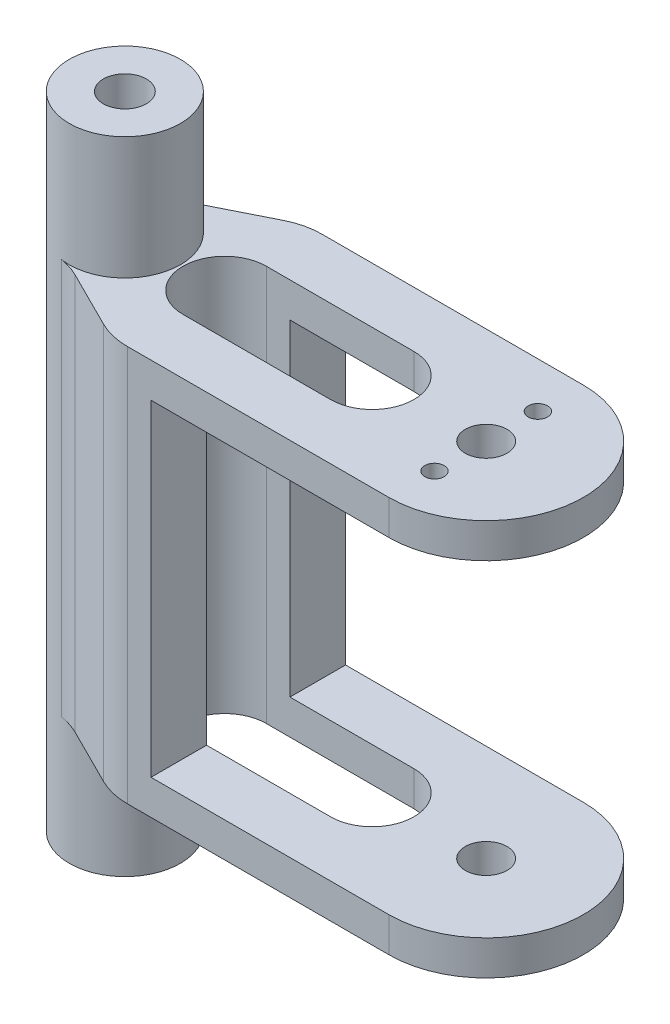
ISO-10303-21;
HEADER;
FILE_DESCRIPTION(('STEP AP214'),'2;1');
FILE_NAME('part.step','',(''),(''),'','','');
FILE_SCHEMA(('AUTOMOTIVE_DESIGN { 1 0 10303 214 1 1 1 1 }'));
ENDSEC;
DATA;
#1=APPLICATION_CONTEXT('core data for automotive mechanical design processes');
#2=APPLICATION_PROTOCOL_DEFINITION('international standard','automotive_design',2000,#1);
#3=PRODUCT_CONTEXT('',#1,'mechanical');
#4=PRODUCT('Part','Part','',(#3));
#5=PRODUCT_RELATED_PRODUCT_CATEGORY('part','',(#4));
#6=PRODUCT_DEFINITION_FORMATION('','',#4);
#7=PRODUCT_DEFINITION_CONTEXT('part definition',#1,'design');
#8=PRODUCT_DEFINITION('design','',#6,#7);
#9=PRODUCT_DEFINITION_SHAPE('','',#8);
#10=(LENGTH_UNIT() NAMED_UNIT(*) SI_UNIT(.MILLI.,.METRE.));
#11=(NAMED_UNIT(*) PLANE_ANGLE_UNIT() SI_UNIT($,.RADIAN.));
#12=(NAMED_UNIT(*) SI_UNIT($,.STERADIAN.) SOLID_ANGLE_UNIT());
#13=UNCERTAINTY_MEASURE_WITH_UNIT(LENGTH_MEASURE(1.E-05),#10,'distance_accuracy_value','');
#14=(GEOMETRIC_REPRESENTATION_CONTEXT(3) GLOBAL_UNCERTAINTY_ASSIGNED_CONTEXT((#13)) GLOBAL_UNIT_ASSIGNED_CONTEXT((#10,
#11,#12)) REPRESENTATION_CONTEXT('',''));
#15=CARTESIAN_POINT('',(0.,0.,0.));
#16=DIRECTION('',(0.,0.,1.));
#17=DIRECTION('',(1.,0.,0.));
#18=AXIS2_PLACEMENT_3D('',#15,#16,#17);
#19=CARTESIAN_POINT('',(-57.1806055924693,52.,14.));
#20=DIRECTION('',(-1.,0.,0.));
#21=DIRECTION('',(0.,0.,1.));
#22=AXIS2_PLACEMENT_3D('',#19,#20,#21);
#23=PLANE('',#22);
#24=DIRECTION('',(0.,-1.,0.));
#25=VECTOR('',#24,1.);
#26=CARTESIAN_POINT('',(-57.1806055924693,52.,6.));
#27=LINE('',#26,#25);
#28=CARTESIAN_POINT('',(-57.1806055924693,52.,6.));
#29=VERTEX_POINT('',#28);
#30=CARTESIAN_POINT('',(-57.1806055924693,5.,6.));
#31=VERTEX_POINT('',#30);
#32=EDGE_CURVE('E258',#29,#31,#27,.T.);
#33=ORIENTED_EDGE('',*,*,#32,.F.);
#34=DIRECTION('',(0.,0.,-1.));
#35=VECTOR('',#34,1.);
#36=CARTESIAN_POINT('',(-57.1806055924693,52.,14.));
#37=LINE('',#36,#35);
#38=CARTESIAN_POINT('',(-57.1806055924693,52.,14.));
#39=VERTEX_POINT('',#38);
#40=EDGE_CURVE('E345',#39,#29,#37,.T.);
#41=ORIENTED_EDGE('',*,*,#40,.F.);
#42=DIRECTION('',(0.,-1.,0.));
#43=VECTOR('',#42,1.);
#44=CARTESIAN_POINT('',(-57.1806055924693,52.,14.));
#45=LINE('',#44,#43);
#46=CARTESIAN_POINT('',(-57.1806055924693,5.,14.));
#47=VERTEX_POINT('',#46);
#48=EDGE_CURVE('E358',#39,#47,#45,.T.);
#49=ORIENTED_EDGE('',*,*,#48,.T.);
#50=DIRECTION('',(0.,0.,-1.));
#51=VECTOR('',#50,1.);
#52=CARTESIAN_POINT('',(-57.1806055924693,5.,14.));
#53=LINE('',#52,#51);
#54=EDGE_CURVE('E351',#47,#31,#53,.T.);
#55=ORIENTED_EDGE('',*,*,#54,.T.);
#56=EDGE_LOOP('',(#33,#41,#49,#55));
#57=FACE_BOUND('',#56,.T.);
#58=ADVANCED_FACE('F41',(#57),#23,.F.);
#59=CARTESIAN_POINT('',(0.,5.,14.));
#60=DIRECTION('',(0.,0.,-1.));
#61=DIRECTION('',(-1.,0.,0.));
#62=AXIS2_PLACEMENT_3D('',#59,#60,#61);
#63=PLANE('',#62);
#64=DIRECTION('',(1.,0.,0.));
#65=VECTOR('',#64,1.);
#66=CARTESIAN_POINT('',(0.,57.,14.));
#67=LINE('',#66,#65);
#68=CARTESIAN_POINT('',(-60.5813685126219,57.,14.));
#69=VERTEX_POINT('',#68);
#70=CARTESIAN_POINT('',(-22.9420482876198,57.,14.));
#71=VERTEX_POINT('',#70);
#72=EDGE_CURVE('E309',#69,#71,#67,.T.);
#73=ORIENTED_EDGE('',*,*,#72,.F.);
#74=DIRECTION('',(0.,-1.,0.));
#75=VECTOR('',#74,1.);
#76=CARTESIAN_POINT('',(-60.5813685126219,5.,14.));
#77=LINE('',#76,#75);
#78=CARTESIAN_POINT('',(-60.5813685126219,0.,14.));
#79=VERTEX_POINT('',#78);
#80=EDGE_CURVE('E419',#69,#79,#77,.T.);
#81=ORIENTED_EDGE('',*,*,#80,.T.);
#82=DIRECTION('',(1.,0.,0.));
#83=VECTOR('',#82,1.);
#84=CARTESIAN_POINT('',(0.,0.,14.));
#85=LINE('',#84,#83);
#86=CARTESIAN_POINT('',(-22.9420482876198,0.,14.));
#87=VERTEX_POINT('',#86);
#88=EDGE_CURVE('E362',#79,#87,#85,.T.);
#89=ORIENTED_EDGE('',*,*,#88,.T.);
#90=DIRECTION('',(0.,-1.,0.));
#91=VECTOR('',#90,1.);
#92=CARTESIAN_POINT('',(-22.9420482876198,5.,14.));
#93=LINE('',#92,#91);
#94=CARTESIAN_POINT('',(-22.9420482876198,5.,14.));
#95=VERTEX_POINT('',#94);
#96=EDGE_CURVE('E394',#95,#87,#93,.T.);
#97=ORIENTED_EDGE('',*,*,#96,.F.);
#98=DIRECTION('',(1.,0.,0.));
#99=VECTOR('',#98,1.);
#100=CARTESIAN_POINT('',(0.,5.,14.));
#101=LINE('',#100,#99);
#102=EDGE_CURVE('E363',#47,#95,#101,.T.);
#103=ORIENTED_EDGE('',*,*,#102,.F.);
#104=ORIENTED_EDGE('',*,*,#48,.F.);
#105=DIRECTION('',(1.,0.,0.));
#106=VECTOR('',#105,1.);
#107=CARTESIAN_POINT('',(0.,52.,14.));
#108=LINE('',#107,#106);
#109=CARTESIAN_POINT('',(-22.9420482876198,52.,14.));
#110=VERTEX_POINT('',#109);
#111=EDGE_CURVE('E301',#39,#110,#108,.T.);
#112=ORIENTED_EDGE('',*,*,#111,.T.);
#113=DIRECTION('',(0.,-1.,0.));
#114=VECTOR('',#113,1.);
#115=CARTESIAN_POINT('',(-22.9420482876198,57.,14.));
#116=LINE('',#115,#114);
#117=EDGE_CURVE('E340',#71,#110,#116,.T.);
#118=ORIENTED_EDGE('',*,*,#117,.F.);
#119=EDGE_LOOP('',(#73,#81,#89,#97,#103,#104,#112,#118));
#120=FACE_BOUND('',#119,.T.);
#121=ADVANCED_FACE('F484',(#120),#63,.F.);
#122=CARTESIAN_POINT('',(-22.9420482876198,5.,0.));
#123=DIRECTION('',(0.,-1.,0.));
#124=DIRECTION('',(0.,0.,-1.));
#125=AXIS2_PLACEMENT_3D('',#122,#123,#124);
#126=CYLINDRICAL_SURFACE('',#125,14.);
#127=CARTESIAN_POINT('',(-22.9420482876198,0.,0.));
#128=DIRECTION('',(0.,1.,0.));
#129=DIRECTION('',(0.,0.,1.));
#130=AXIS2_PLACEMENT_3D('',#127,#128,#129);
#131=CIRCLE('',#130,14.);
#132=CARTESIAN_POINT('',(-22.9420482876198,0.,-14.));
#133=VERTEX_POINT('',#132);
#134=EDGE_CURVE('E381',#87,#133,#131,.T.);
#135=ORIENTED_EDGE('',*,*,#134,.T.);
#136=DIRECTION('',(0.,-1.,0.));
#137=VECTOR('',#136,1.);
#138=CARTESIAN_POINT('',(-22.9420482876198,5.,-14.));
#139=LINE('',#138,#137);
#140=CARTESIAN_POINT('',(-22.9420482876198,5.,-14.));
#141=VERTEX_POINT('',#140);
#142=EDGE_CURVE('E378',#141,#133,#139,.T.);
#143=ORIENTED_EDGE('',*,*,#142,.F.);
#144=CARTESIAN_POINT('',(-22.9420482876198,5.,0.));
#145=DIRECTION('',(0.,1.,0.));
#146=DIRECTION('',(0.,0.,1.));
#147=AXIS2_PLACEMENT_3D('',#144,#145,#146);
#148=CIRCLE('',#147,14.);
#149=EDGE_CURVE('E366',#95,#141,#148,.T.);
#150=ORIENTED_EDGE('',*,*,#149,.F.);
#151=ORIENTED_EDGE('',*,*,#96,.T.);
#152=EDGE_LOOP('',(#135,#143,#150,#151));
#153=FACE_BOUND('',#152,.T.);
#154=ADVANCED_FACE('F477',(#153),#126,.T.);
#155=CARTESIAN_POINT('',(0.,5.,-14.));
#156=DIRECTION('',(0.,0.,1.));
#157=DIRECTION('',(1.,0.,0.));
#158=AXIS2_PLACEMENT_3D('',#155,#156,#157);
#159=PLANE('',#158);
#160=DIRECTION('',(-1.,0.,0.));
#161=VECTOR('',#160,1.);
#162=CARTESIAN_POINT('',(0.,0.,-14.));
#163=LINE('',#162,#161);
#164=CARTESIAN_POINT('',(-60.5813685126219,0.,-14.));
#165=VERTEX_POINT('',#164);
#166=EDGE_CURVE('E384',#133,#165,#163,.T.);
#167=ORIENTED_EDGE('',*,*,#166,.T.);
#168=DIRECTION('',(0.,-1.,0.));
#169=VECTOR('',#168,1.);
#170=CARTESIAN_POINT('',(-60.5813685126219,57.,-14.));
#171=LINE('',#170,#169);
#172=CARTESIAN_POINT('',(-60.5813685126219,57.,-14.));
#173=VERTEX_POINT('',#172);
#174=EDGE_CURVE('E409',#165,#173,#171,.F.);
#175=ORIENTED_EDGE('',*,*,#174,.T.);
#176=DIRECTION('',(-1.,0.,0.));
#177=VECTOR('',#176,1.);
#178=CARTESIAN_POINT('',(0.,57.,-14.));
#179=LINE('',#178,#177);
#180=CARTESIAN_POINT('',(-22.9420482876198,57.,-14.));
#181=VERTEX_POINT('',#180);
#182=EDGE_CURVE('E316',#181,#173,#179,.T.);
#183=ORIENTED_EDGE('',*,*,#182,.F.);
#184=DIRECTION('',(0.,-1.,0.));
#185=VECTOR('',#184,1.);
#186=CARTESIAN_POINT('',(-22.9420482876198,57.,-14.));
#187=LINE('',#186,#185);
#188=CARTESIAN_POINT('',(-22.9420482876198,52.,-14.));
#189=VERTEX_POINT('',#188);
#190=EDGE_CURVE('E324',#181,#189,#187,.T.);
#191=ORIENTED_EDGE('',*,*,#190,.T.);
#192=DIRECTION('',(-1.,0.,0.));
#193=VECTOR('',#192,1.);
#194=CARTESIAN_POINT('',(0.,52.,-14.));
#195=LINE('',#194,#193);
#196=CARTESIAN_POINT('',(-57.1806055924693,52.,-14.));
#197=VERTEX_POINT('',#196);
#198=EDGE_CURVE('E330',#189,#197,#195,.T.);
#199=ORIENTED_EDGE('',*,*,#198,.T.);
#200=DIRECTION('',(0.,-1.,0.));
#201=VECTOR('',#200,1.);
#202=CARTESIAN_POINT('',(-57.1806055924693,52.,-14.));
#203=LINE('',#202,#201);
#204=CARTESIAN_POINT('',(-57.1806055924693,5.,-14.));
#205=VERTEX_POINT('',#204);
#206=EDGE_CURVE('E349',#197,#205,#203,.T.);
#207=ORIENTED_EDGE('',*,*,#206,.T.);
#208=DIRECTION('',(-1.,0.,0.));
#209=VECTOR('',#208,1.);
#210=CARTESIAN_POINT('',(0.,5.,-14.));
#211=LINE('',#210,#209);
#212=EDGE_CURVE('E370',#141,#205,#211,.T.);
#213=ORIENTED_EDGE('',*,*,#212,.F.);
#214=ORIENTED_EDGE('',*,*,#142,.T.);
#215=EDGE_LOOP('',(#167,#175,#183,#191,#199,#207,#213,#214));
#216=FACE_BOUND('',#215,.T.);
#217=ADVANCED_FACE('F472',(#216),#159,.F.);
#218=CARTESIAN_POINT('',(-22.9420482876198,5.,0.));
#219=DIRECTION('',(0.,-1.,0.));
#220=DIRECTION('',(0.,0.,-1.));
#221=AXIS2_PLACEMENT_3D('',#218,#219,#220);
#222=CYLINDRICAL_SURFACE('',#221,3.);
#223=CARTESIAN_POINT('',(-22.9420482876198,5.,0.));
#224=DIRECTION('',(0.,1.,0.));
#225=DIRECTION('',(0.,0.,1.));
#226=AXIS2_PLACEMENT_3D('',#223,#224,#225);
#227=CIRCLE('',#226,3.);
#228=CARTESIAN_POINT('',(-22.9420482876198,5.,3.));
#229=VERTEX_POINT('',#228);
#230=EDGE_CURVE('E374',#229,#229,#227,.T.);
#231=ORIENTED_EDGE('',*,*,#230,.T.);
#232=EDGE_LOOP('',(#231));
#233=FACE_BOUND('',#232,.T.);
#234=CARTESIAN_POINT('',(-22.9420482876198,0.,0.));
#235=DIRECTION('',(0.,1.,0.));
#236=DIRECTION('',(0.,0.,1.));
#237=AXIS2_PLACEMENT_3D('',#234,#235,#236);
#238=CIRCLE('',#237,3.);
#239=CARTESIAN_POINT('',(-22.9420482876198,0.,3.));
#240=VERTEX_POINT('',#239);
#241=EDGE_CURVE('E367',#240,#240,#238,.T.);
#242=ORIENTED_EDGE('',*,*,#241,.F.);
#243=EDGE_LOOP('',(#242));
#244=FACE_BOUND('',#243,.T.);
#245=ADVANCED_FACE('F627',(#233,#244),#222,.F.);
#246=CARTESIAN_POINT('',(0.,5.,0.));
#247=DIRECTION('',(0.,1.,0.));
#248=DIRECTION('',(0.,0.,1.));
#249=AXIS2_PLACEMENT_3D('',#246,#247,#248);
#250=PLANE('',#249);
#251=DIRECTION('',(-1.,0.,0.));
#252=VECTOR('',#251,1.);
#253=CARTESIAN_POINT('',(0.,5.,-5.99999999999999));
#254=LINE('',#253,#252);
#255=CARTESIAN_POINT('',(-39.3384096662004,5.00000000000001,-6.));
#256=VERTEX_POINT('',#255);
#257=CARTESIAN_POINT('',(-57.1806055924693,5.,-6.));
#258=VERTEX_POINT('',#257);
#259=EDGE_CURVE('E271',#256,#258,#254,.T.);
#260=ORIENTED_EDGE('',*,*,#259,.F.);
#261=CARTESIAN_POINT('',(-39.3384096662004,5.,0.));
#262=DIRECTION('',(0.,1.,0.));
#263=DIRECTION('',(0.,0.,1.));
#264=AXIS2_PLACEMENT_3D('',#261,#262,#263);
#265=CIRCLE('',#264,6.);
#266=CARTESIAN_POINT('',(-39.3384096662004,5.00000000000001,6.));
#267=VERTEX_POINT('',#266);
#268=EDGE_CURVE('E252',#267,#256,#265,.T.);
#269=ORIENTED_EDGE('',*,*,#268,.F.);
#270=DIRECTION('',(-1.,0.,0.));
#271=VECTOR('',#270,1.);
#272=CARTESIAN_POINT('',(0.,5.,6.00000000000001));
#273=LINE('',#272,#271);
#274=EDGE_CURVE('E261',#267,#31,#273,.T.);
#275=ORIENTED_EDGE('',*,*,#274,.T.);
#276=ORIENTED_EDGE('',*,*,#54,.F.);
#277=ORIENTED_EDGE('',*,*,#102,.T.);
#278=ORIENTED_EDGE('',*,*,#149,.T.);
#279=ORIENTED_EDGE('',*,*,#212,.T.);
#280=EDGE_CURVE('E344',#258,#205,#53,.T.);
#281=ORIENTED_EDGE('',*,*,#280,.F.);
#282=EDGE_LOOP('',(#260,#269,#275,#276,#277,#278,#279,#281));
#283=FACE_BOUND('',#282,.T.);
#284=ORIENTED_EDGE('',*,*,#230,.F.);
#285=EDGE_LOOP('',(#284));
#286=FACE_BOUND('',#285,.T.);
#287=ADVANCED_FACE('F537',(#283,#286),#250,.T.);
#288=CARTESIAN_POINT('',(0.,0.,0.));
#289=DIRECTION('',(0.,1.,0.));
#290=DIRECTION('',(0.,0.,1.));
#291=AXIS2_PLACEMENT_3D('',#288,#289,#290);
#292=PLANE('',#291);
#293=CARTESIAN_POINT('',(-39.3384096662004,0.,0.));
#294=DIRECTION('',(0.,-1.,0.));
#295=DIRECTION('',(0.,0.,-1.));
#296=AXIS2_PLACEMENT_3D('',#293,#294,#295);
#297=CIRCLE('',#296,6.);
#298=CARTESIAN_POINT('',(-39.3384096662004,0.,-6.));
#299=VERTEX_POINT('',#298);
#300=CARTESIAN_POINT('',(-39.3384096662004,0.,6.));
#301=VERTEX_POINT('',#300);
#302=EDGE_CURVE('E233',#299,#301,#297,.T.);
#303=ORIENTED_EDGE('',*,*,#302,.F.);
#304=DIRECTION('',(1.,0.,0.));
#305=VECTOR('',#304,1.);
#306=CARTESIAN_POINT('',(-60.5813685126219,0.,-6.));
#307=LINE('',#306,#305);
#308=CARTESIAN_POINT('',(-60.5813685126219,0.,-5.99999999999999));
#309=VERTEX_POINT('',#308);
#310=EDGE_CURVE('E57',#309,#299,#307,.T.);
#311=ORIENTED_EDGE('',*,*,#310,.F.);
#312=CARTESIAN_POINT('',(-60.5813685126219,0.,0.));
#313=DIRECTION('',(0.,-1.,0.));
#314=DIRECTION('',(0.,0.,-1.));
#315=AXIS2_PLACEMENT_3D('',#312,#313,#314);
#316=CIRCLE('',#315,6.);
#317=CARTESIAN_POINT('',(-60.5813685126219,0.,5.99999999999999));
#318=VERTEX_POINT('',#317);
#319=EDGE_CURVE('E217',#318,#309,#316,.T.);
#320=ORIENTED_EDGE('',*,*,#319,.F.);
#321=DIRECTION('',(1.,0.,0.));
#322=VECTOR('',#321,1.);
#323=CARTESIAN_POINT('',(-60.5813685126219,0.,5.99999999999999));
#324=LINE('',#323,#322);
#325=EDGE_CURVE('E221',#318,#301,#324,.T.);
#326=ORIENTED_EDGE('',*,*,#325,.T.);
#327=EDGE_LOOP('',(#303,#311,#320,#326));
#328=FACE_BOUND('',#327,.T.);
#329=CARTESIAN_POINT('',(-74.9420482876198,0.,0.));
#330=DIRECTION('',(0.,-1.,0.));
#331=DIRECTION('',(0.,0.,-1.));
#332=AXIS2_PLACEMENT_3D('',#329,#330,#331);
#333=CIRCLE('',#332,8.);
#334=CARTESIAN_POINT('',(-76.1857808279064,0.,7.9027292354118));
#335=VERTEX_POINT('',#334);
#336=CARTESIAN_POINT('',(-76.1857808279064,0.,-7.90272923541178));
#337=VERTEX_POINT('',#336);
#338=EDGE_CURVE('E304',#335,#337,#333,.F.);
#339=ORIENTED_EDGE('',*,*,#338,.T.);
#340=CARTESIAN_POINT('',(-77.7404465032646,0.,-17.7811407796765));
#341=DIRECTION('',(0.,1.,0.));
#342=DIRECTION('',(0.,0.,1.));
#343=AXIS2_PLACEMENT_3D('',#340,#341,#342);
#344=CIRCLE('',#343,10.);
#345=CARTESIAN_POINT('',(-73.2683105482651,0.,-8.83686886967737));
#346=VERTEX_POINT('',#345);
#347=EDGE_CURVE('E50',#337,#346,#344,.T.);
#348=ORIENTED_EDGE('',*,*,#347,.T.);
#349=DIRECTION('',(0.894427190999916,0.,-0.447213595499958));
#350=VECTOR('',#349,1.);
#351=CARTESIAN_POINT('',(-18.188409657524,0.,-36.3768193150479));
#352=LINE('',#351,#350);
#353=CARTESIAN_POINT('',(-65.0535044676215,0.,-12.9442719099991));
#354=VERTEX_POINT('',#353);
#355=EDGE_CURVE('E295',#346,#354,#352,.T.);
#356=ORIENTED_EDGE('',*,*,#355,.T.);
#357=CARTESIAN_POINT('',(-60.5813685126219,0.,-3.99999999999999));
#358=DIRECTION('',(0.,1.,0.));
#359=DIRECTION('',(0.,0.,1.));
#360=AXIS2_PLACEMENT_3D('',#357,#358,#359);
#361=CIRCLE('',#360,10.);
#362=EDGE_CURVE('E406',#354,#165,#361,.F.);
#363=ORIENTED_EDGE('',*,*,#362,.T.);
#364=ORIENTED_EDGE('',*,*,#166,.F.);
#365=ORIENTED_EDGE('',*,*,#134,.F.);
#366=ORIENTED_EDGE('',*,*,#88,.F.);
#367=CARTESIAN_POINT('',(-60.5813685126219,0.,4.));
#368=DIRECTION('',(0.,1.,0.));
#369=DIRECTION('',(0.,0.,1.));
#370=AXIS2_PLACEMENT_3D('',#367,#368,#369);
#371=CIRCLE('',#370,10.);
#372=CARTESIAN_POINT('',(-65.0535044676215,0.,12.9442719099991));
#373=VERTEX_POINT('',#372);
#374=EDGE_CURVE('E402',#79,#373,#371,.F.);
#375=ORIENTED_EDGE('',*,*,#374,.T.);
#376=DIRECTION('',(0.894427190999916,0.,0.447213595499958));
#377=VECTOR('',#376,1.);
#378=CARTESIAN_POINT('',(-18.188409657524,0.,36.3768193150479));
#379=LINE('',#378,#377);
#380=CARTESIAN_POINT('',(-73.2683105482651,0.,8.83686886967738));
#381=VERTEX_POINT('',#380);
#382=EDGE_CURVE('E290',#381,#373,#379,.T.);
#383=ORIENTED_EDGE('',*,*,#382,.F.);
#384=CARTESIAN_POINT('',(-77.7404465032646,0.,17.7811407796765));
#385=DIRECTION('',(0.,1.,0.));
#386=DIRECTION('',(0.,0.,1.));
#387=AXIS2_PLACEMENT_3D('',#384,#385,#386);
#388=CIRCLE('',#387,10.);
#389=EDGE_CURVE('E442',#381,#335,#388,.T.);
#390=ORIENTED_EDGE('',*,*,#389,.T.);
#391=EDGE_LOOP('',(#339,#348,#356,#363,#364,#365,#366,#375,#383,#390));
#392=FACE_BOUND('',#391,.T.);
#393=ORIENTED_EDGE('',*,*,#241,.T.);
#394=EDGE_LOOP('',(#393));
#395=FACE_BOUND('',#394,.T.);
#396=ADVANCED_FACE('F452',(#328,#392,#395),#292,.F.);
#397=CARTESIAN_POINT('',(-57.1806055924693,52.,-6.));
#398=VERTEX_POINT('',#397);
#399=EDGE_CURVE('E350',#398,#197,#37,.T.);
#400=ORIENTED_EDGE('',*,*,#399,.F.);
#401=DIRECTION('',(0.,-1.,0.));
#402=VECTOR('',#401,1.);
#403=CARTESIAN_POINT('',(-57.1806055924693,52.,-6.));
#404=LINE('',#403,#402);
#405=EDGE_CURVE('E267',#398,#258,#404,.T.);
#406=ORIENTED_EDGE('',*,*,#405,.T.);
#407=ORIENTED_EDGE('',*,*,#280,.T.);
#408=ORIENTED_EDGE('',*,*,#206,.F.);
#409=EDGE_LOOP('',(#400,#406,#407,#408));
#410=FACE_BOUND('',#409,.T.);
#411=ADVANCED_FACE('F519',(#410),#23,.F.);
#412=CARTESIAN_POINT('',(0.,52.,0.));
#413=DIRECTION('',(0.,1.,0.));
#414=DIRECTION('',(0.,0.,1.));
#415=AXIS2_PLACEMENT_3D('',#412,#413,#414);
#416=PLANE('',#415);
#417=CARTESIAN_POINT('',(-39.3384096662004,52.,0.));
#418=DIRECTION('',(0.,1.,0.));
#419=DIRECTION('',(0.,0.,1.));
#420=AXIS2_PLACEMENT_3D('',#417,#418,#419);
#421=CIRCLE('',#420,6.);
#422=CARTESIAN_POINT('',(-39.3384096662004,52.,6.));
#423=VERTEX_POINT('',#422);
#424=CARTESIAN_POINT('',(-39.3384096662004,52.,-6.));
#425=VERTEX_POINT('',#424);
#426=EDGE_CURVE('E244',#423,#425,#421,.T.);
#427=ORIENTED_EDGE('',*,*,#426,.T.);
#428=DIRECTION('',(-1.,0.,0.));
#429=VECTOR('',#428,1.);
#430=CARTESIAN_POINT('',(0.,52.,-5.99999999999999));
#431=LINE('',#430,#429);
#432=EDGE_CURVE('E195',#425,#398,#431,.T.);
#433=ORIENTED_EDGE('',*,*,#432,.T.);
#434=ORIENTED_EDGE('',*,*,#399,.T.);
#435=ORIENTED_EDGE('',*,*,#198,.F.);
#436=CARTESIAN_POINT('',(-22.9420482876198,52.,0.));
#437=DIRECTION('',(0.,1.,0.));
#438=DIRECTION('',(0.,0.,1.));
#439=AXIS2_PLACEMENT_3D('',#436,#437,#438);
#440=CIRCLE('',#439,14.);
#441=EDGE_CURVE('E327',#110,#189,#440,.T.);
#442=ORIENTED_EDGE('',*,*,#441,.F.);
#443=ORIENTED_EDGE('',*,*,#111,.F.);
#444=ORIENTED_EDGE('',*,*,#40,.T.);
#445=DIRECTION('',(-1.,0.,0.));
#446=VECTOR('',#445,1.);
#447=CARTESIAN_POINT('',(0.,52.,6.00000000000001));
#448=LINE('',#447,#446);
#449=EDGE_CURVE('E255',#423,#29,#448,.T.);
#450=ORIENTED_EDGE('',*,*,#449,.F.);
#451=EDGE_LOOP('',(#427,#433,#434,#435,#442,#443,#444,#450));
#452=FACE_BOUND('',#451,.T.);
#453=CARTESIAN_POINT('',(-22.9420482876198,52.,0.));
#454=DIRECTION('',(0.,1.,0.));
#455=DIRECTION('',(0.,0.,1.));
#456=AXIS2_PLACEMENT_3D('',#453,#454,#455);
#457=CIRCLE('',#456,3.);
#458=CARTESIAN_POINT('',(-22.9420482876198,52.,3.));
#459=VERTEX_POINT('',#458);
#460=EDGE_CURVE('E313',#459,#459,#457,.T.);
#461=ORIENTED_EDGE('',*,*,#460,.T.);
#462=EDGE_LOOP('',(#461));
#463=FACE_BOUND('',#462,.T.);
#464=ADVANCED_FACE('F528',(#452,#463),#416,.F.);
#465=CARTESIAN_POINT('',(-22.9420482876198,57.,0.));
#466=DIRECTION('',(0.,-1.,0.));
#467=DIRECTION('',(0.,0.,-1.));
#468=AXIS2_PLACEMENT_3D('',#465,#466,#467);
#469=CYLINDRICAL_SURFACE('',#468,14.);
#470=ORIENTED_EDGE('',*,*,#441,.T.);
#471=ORIENTED_EDGE('',*,*,#190,.F.);
#472=CARTESIAN_POINT('',(-22.9420482876198,57.,0.));
#473=DIRECTION('',(0.,1.,0.));
#474=DIRECTION('',(0.,0.,1.));
#475=AXIS2_PLACEMENT_3D('',#472,#473,#474);
#476=CIRCLE('',#475,14.);
#477=EDGE_CURVE('E312',#71,#181,#476,.T.);
#478=ORIENTED_EDGE('',*,*,#477,.F.);
#479=ORIENTED_EDGE('',*,*,#117,.T.);
#480=EDGE_LOOP('',(#470,#471,#478,#479));
#481=FACE_BOUND('',#480,.T.);
#482=ADVANCED_FACE('F534',(#481),#469,.T.);
#483=CARTESIAN_POINT('',(-22.9420482876198,57.,0.));
#484=DIRECTION('',(0.,-1.,0.));
#485=DIRECTION('',(0.,0.,-1.));
#486=AXIS2_PLACEMENT_3D('',#483,#484,#485);
#487=CYLINDRICAL_SURFACE('',#486,3.);
#488=CARTESIAN_POINT('',(-22.9420482876198,57.,0.));
#489=DIRECTION('',(0.,1.,0.));
#490=DIRECTION('',(0.,0.,1.));
#491=AXIS2_PLACEMENT_3D('',#488,#489,#490);
#492=CIRCLE('',#491,3.);
#493=CARTESIAN_POINT('',(-22.9420482876198,57.,3.));
#494=VERTEX_POINT('',#493);
#495=EDGE_CURVE('E320',#494,#494,#492,.T.);
#496=ORIENTED_EDGE('',*,*,#495,.T.);
#497=EDGE_LOOP('',(#496));
#498=FACE_BOUND('',#497,.T.);
#499=ORIENTED_EDGE('',*,*,#460,.F.);
#500=EDGE_LOOP('',(#499));
#501=FACE_BOUND('',#500,.T.);
#502=ADVANCED_FACE('F569',(#498,#501),#487,.F.);
#503=CARTESIAN_POINT('',(0.,57.,0.));
#504=DIRECTION('',(0.,1.,0.));
#505=DIRECTION('',(0.,0.,1.));
#506=AXIS2_PLACEMENT_3D('',#503,#504,#505);
#507=PLANE('',#506);
#508=CARTESIAN_POINT('',(-22.9420482876198,57.,7.4422));
#509=DIRECTION('',(0.,1.,0.));
#510=DIRECTION('',(0.,0.,1.));
#511=AXIS2_PLACEMENT_3D('',#508,#509,#510);
#512=CIRCLE('',#511,1.395);
#513=CARTESIAN_POINT('',(-22.9420482876198,57.,8.8372));
#514=VERTEX_POINT('',#513);
#515=EDGE_CURVE('E858',#514,#514,#512,.T.);
#516=ORIENTED_EDGE('',*,*,#515,.F.);
#517=EDGE_LOOP('',(#516));
#518=FACE_BOUND('',#517,.T.);
#519=CARTESIAN_POINT('',(-22.9420482876198,57.,-7.4422));
#520=DIRECTION('',(0.,1.,0.));
#521=DIRECTION('',(0.,0.,1.));
#522=AXIS2_PLACEMENT_3D('',#519,#520,#521);
#523=CIRCLE('',#522,1.395);
#524=CARTESIAN_POINT('',(-22.9420482876198,57.,-6.0472));
#525=VERTEX_POINT('',#524);
#526=EDGE_CURVE('E862',#525,#525,#523,.T.);
#527=ORIENTED_EDGE('',*,*,#526,.F.);
#528=EDGE_LOOP('',(#527));
#529=FACE_BOUND('',#528,.T.);
#530=DIRECTION('',(1.,0.,0.));
#531=VECTOR('',#530,1.);
#532=CARTESIAN_POINT('',(-60.5813685126219,57.,-6.));
#533=LINE('',#532,#531);
#534=CARTESIAN_POINT('',(-60.5813685126219,57.,-5.99999999999999));
#535=VERTEX_POINT('',#534);
#536=CARTESIAN_POINT('',(-39.3384096662004,57.,-6.));
#537=VERTEX_POINT('',#536);
#538=EDGE_CURVE('E192',#535,#537,#533,.T.);
#539=ORIENTED_EDGE('',*,*,#538,.T.);
#540=CARTESIAN_POINT('',(-39.3384096662004,57.,0.));
#541=DIRECTION('',(0.,-1.,0.));
#542=DIRECTION('',(0.,0.,-1.));
#543=AXIS2_PLACEMENT_3D('',#540,#541,#542);
#544=CIRCLE('',#543,6.);
#545=CARTESIAN_POINT('',(-39.3384096662004,57.,6.));
#546=VERTEX_POINT('',#545);
#547=EDGE_CURVE('E202',#537,#546,#544,.T.);
#548=ORIENTED_EDGE('',*,*,#547,.T.);
#549=DIRECTION('',(1.,0.,0.));
#550=VECTOR('',#549,1.);
#551=CARTESIAN_POINT('',(-60.5813685126219,57.,5.99999999999999));
#552=LINE('',#551,#550);
#553=CARTESIAN_POINT('',(-60.5813685126219,57.,5.99999999999999));
#554=VERTEX_POINT('',#553);
#555=EDGE_CURVE('E210',#554,#546,#552,.T.);
#556=ORIENTED_EDGE('',*,*,#555,.F.);
#557=CARTESIAN_POINT('',(-60.5813685126219,57.,0.));
#558=DIRECTION('',(0.,-1.,0.));
#559=DIRECTION('',(0.,0.,-1.));
#560=AXIS2_PLACEMENT_3D('',#557,#558,#559);
#561=CIRCLE('',#560,6.);
#562=EDGE_CURVE('E215',#554,#535,#561,.T.);
#563=ORIENTED_EDGE('',*,*,#562,.T.);
#564=EDGE_LOOP('',(#539,#548,#556,#563));
#565=FACE_BOUND('',#564,.T.);
#566=ORIENTED_EDGE('',*,*,#182,.T.);
#567=CARTESIAN_POINT('',(-60.5813685126219,57.,-3.99999999999999));
#568=DIRECTION('',(0.,1.,0.));
#569=DIRECTION('',(0.,0.,1.));
#570=AXIS2_PLACEMENT_3D('',#567,#568,#569);
#571=CIRCLE('',#570,10.);
#572=CARTESIAN_POINT('',(-65.0535044676215,57.,-12.9442719099991));
#573=VERTEX_POINT('',#572);
#574=EDGE_CURVE('E415',#173,#573,#571,.T.);
#575=ORIENTED_EDGE('',*,*,#574,.T.);
#576=DIRECTION('',(0.894427190999916,0.,-0.447213595499958));
#577=VECTOR('',#576,1.);
#578=CARTESIAN_POINT('',(-18.188409657524,57.,-36.3768193150479));
#579=LINE('',#578,#577);
#580=CARTESIAN_POINT('',(-73.2683105482651,57.,-8.83686886967737));
#581=VERTEX_POINT('',#580);
#582=EDGE_CURVE('E298',#581,#573,#579,.T.);
#583=ORIENTED_EDGE('',*,*,#582,.F.);
#584=CARTESIAN_POINT('',(-77.7404465032646,57.,-17.7811407796765));
#585=DIRECTION('',(0.,1.,0.));
#586=DIRECTION('',(0.,0.,1.));
#587=AXIS2_PLACEMENT_3D('',#584,#585,#586);
#588=CIRCLE('',#587,10.);
#589=CARTESIAN_POINT('',(-76.1857808279064,57.,-7.90272923541178));
#590=VERTEX_POINT('',#589);
#591=EDGE_CURVE('E11',#581,#590,#588,.F.);
#592=ORIENTED_EDGE('',*,*,#591,.T.);
#593=CARTESIAN_POINT('',(-74.9420482876198,57.,0.));
#594=DIRECTION('',(0.,-1.,0.));
#595=DIRECTION('',(0.,0.,-1.));
#596=AXIS2_PLACEMENT_3D('',#593,#594,#595);
#597=CIRCLE('',#596,8.);
#598=CARTESIAN_POINT('',(-76.1857808279064,57.,7.9027292354118));
#599=VERTEX_POINT('',#598);
#600=EDGE_CURVE('E294',#599,#590,#597,.F.);
#601=ORIENTED_EDGE('',*,*,#600,.F.);
#602=CARTESIAN_POINT('',(-77.7404465032646,57.,17.7811407796765));
#603=DIRECTION('',(0.,1.,0.));
#604=DIRECTION('',(0.,0.,1.));
#605=AXIS2_PLACEMENT_3D('',#602,#603,#604);
#606=CIRCLE('',#605,10.);
#607=CARTESIAN_POINT('',(-73.2683105482651,57.,8.83686886967738));
#608=VERTEX_POINT('',#607);
#609=EDGE_CURVE('E446',#599,#608,#606,.F.);
#610=ORIENTED_EDGE('',*,*,#609,.T.);
#611=DIRECTION('',(0.894427190999916,0.,0.447213595499958));
#612=VECTOR('',#611,1.);
#613=CARTESIAN_POINT('',(-18.188409657524,57.,36.3768193150479));
#614=LINE('',#613,#612);
#615=CARTESIAN_POINT('',(-65.0535044676215,57.,12.9442719099991));
#616=VERTEX_POINT('',#615);
#617=EDGE_CURVE('E291',#608,#616,#614,.T.);
#618=ORIENTED_EDGE('',*,*,#617,.T.);
#619=CARTESIAN_POINT('',(-60.5813685126219,57.,4.));
#620=DIRECTION('',(0.,1.,0.));
#621=DIRECTION('',(0.,0.,1.));
#622=AXIS2_PLACEMENT_3D('',#619,#620,#621);
#623=CIRCLE('',#622,10.);
#624=EDGE_CURVE('E412',#616,#69,#623,.T.);
#625=ORIENTED_EDGE('',*,*,#624,.T.);
#626=ORIENTED_EDGE('',*,*,#72,.T.);
#627=ORIENTED_EDGE('',*,*,#477,.T.);
#628=EDGE_LOOP('',(#566,#575,#583,#592,#601,#610,#618,#625,#626,#627));
#629=FACE_BOUND('',#628,.T.);
#630=ORIENTED_EDGE('',*,*,#495,.F.);
#631=EDGE_LOOP('',(#630));
#632=FACE_BOUND('',#631,.T.);
#633=ADVANCED_FACE('F212',(#518,#529,#565,#629,#632),#507,.T.);
#634=CARTESIAN_POINT('',(-18.188409657524,57.,36.3768193150479));
#635=DIRECTION('',(0.447213595499958,0.,-0.894427190999916));
#636=DIRECTION('',(-0.894427190999916,0.,-0.447213595499958));
#637=AXIS2_PLACEMENT_3D('',#634,#635,#636);
#638=PLANE('',#637);
#639=ORIENTED_EDGE('',*,*,#617,.F.);
#640=DIRECTION('',(0.,1.,0.));
#641=VECTOR('',#640,1.);
#642=CARTESIAN_POINT('',(-73.268310548265,57.,8.83686886967739));
#643=LINE('',#642,#641);
#644=EDGE_CURVE('E427',#608,#381,#643,.F.);
#645=ORIENTED_EDGE('',*,*,#644,.T.);
#646=ORIENTED_EDGE('',*,*,#382,.T.);
#647=DIRECTION('',(0.,-1.,0.));
#648=VECTOR('',#647,1.);
#649=CARTESIAN_POINT('',(-65.0535044676215,57.,12.9442719099992));
#650=LINE('',#649,#648);
#651=EDGE_CURVE('E423',#373,#616,#650,.F.);
#652=ORIENTED_EDGE('',*,*,#651,.T.);
#653=EDGE_LOOP('',(#639,#645,#646,#652));
#654=FACE_BOUND('',#653,.T.);
#655=ADVANCED_FACE('F493',(#654),#638,.F.);
#656=CARTESIAN_POINT('',(-18.188409657524,57.,-36.3768193150479));
#657=DIRECTION('',(-0.447213595499958,0.,-0.894427190999916));
#658=DIRECTION('',(-0.894427190999916,0.,0.447213595499958));
#659=AXIS2_PLACEMENT_3D('',#656,#657,#658);
#660=PLANE('',#659);
#661=ORIENTED_EDGE('',*,*,#355,.F.);
#662=DIRECTION('',(0.,-1.,0.));
#663=VECTOR('',#662,1.);
#664=CARTESIAN_POINT('',(-73.268310548265,57.,-8.83686886967738));
#665=LINE('',#664,#663);
#666=EDGE_CURVE('E439',#346,#581,#665,.F.);
#667=ORIENTED_EDGE('',*,*,#666,.T.);
#668=ORIENTED_EDGE('',*,*,#582,.T.);
#669=DIRECTION('',(0.,-1.,0.));
#670=VECTOR('',#669,1.);
#671=CARTESIAN_POINT('',(-65.0535044676215,0.,-12.9442719099991));
#672=LINE('',#671,#670);
#673=EDGE_CURVE('E398',#573,#354,#672,.T.);
#674=ORIENTED_EDGE('',*,*,#673,.T.);
#675=EDGE_LOOP('',(#661,#667,#668,#674));
#676=FACE_BOUND('',#675,.T.);
#677=ADVANCED_FACE('F459',(#676),#660,.T.);
#678=CARTESIAN_POINT('',(-74.9420482876198,-17.61,0.));
#679=DIRECTION('',(0.,1.,0.));
#680=DIRECTION('',(0.,0.,1.));
#681=AXIS2_PLACEMENT_3D('',#678,#679,#680);
#682=CYLINDRICAL_SURFACE('',#681,8.);
#683=CARTESIAN_POINT('',(-74.9420482876198,74.61,0.));
#684=DIRECTION('',(0.,1.,0.));
#685=DIRECTION('',(0.,0.,1.));
#686=AXIS2_PLACEMENT_3D('',#683,#684,#685);
#687=CIRCLE('',#686,8.);
#688=CARTESIAN_POINT('',(-74.9420482876198,74.61,8.));
#689=VERTEX_POINT('',#688);
#690=EDGE_CURVE('E278',#689,#689,#687,.T.);
#691=ORIENTED_EDGE('',*,*,#690,.F.);
#692=EDGE_LOOP('',(#691));
#693=FACE_BOUND('',#692,.T.);
#694=CARTESIAN_POINT('',(-74.9420482876198,-17.61,0.));
#695=DIRECTION('',(0.,1.,0.));
#696=DIRECTION('',(0.,0.,1.));
#697=AXIS2_PLACEMENT_3D('',#694,#695,#696);
#698=CIRCLE('',#697,8.);
#699=CARTESIAN_POINT('',(-74.9420482876198,-17.61,8.));
#700=VERTEX_POINT('',#699);
#701=EDGE_CURVE('E286',#700,#700,#698,.T.);
#702=ORIENTED_EDGE('',*,*,#701,.T.);
#703=EDGE_LOOP('',(#702));
#704=FACE_BOUND('',#703,.T.);
#705=ORIENTED_EDGE('',*,*,#338,.F.);
#706=DIRECTION('',(0.,1.,0.));
#707=VECTOR('',#706,1.);
#708=CARTESIAN_POINT('',(-76.1857808279064,-17.61,7.9027292354118));
#709=LINE('',#708,#707);
#710=EDGE_CURVE('E435',#335,#599,#709,.T.);
#711=ORIENTED_EDGE('',*,*,#710,.T.);
#712=ORIENTED_EDGE('',*,*,#600,.T.);
#713=DIRECTION('',(0.,1.,0.));
#714=VECTOR('',#713,1.);
#715=CARTESIAN_POINT('',(-76.1857808279064,-17.61,-7.90272923541178));
#716=LINE('',#715,#714);
#717=EDGE_CURVE('E431',#590,#337,#716,.F.);
#718=ORIENTED_EDGE('',*,*,#717,.T.);
#719=EDGE_LOOP('',(#705,#711,#712,#718));
#720=FACE_BOUND('',#719,.T.);
#721=ADVANCED_FACE('F500',(#693,#704,#720),#682,.T.);
#722=CARTESIAN_POINT('',(-74.9420482876198,-17.61,0.));
#723=DIRECTION('',(0.,1.,0.));
#724=DIRECTION('',(0.,0.,1.));
#725=AXIS2_PLACEMENT_3D('',#722,#723,#724);
#726=CYLINDRICAL_SURFACE('',#725,3.1);
#727=CARTESIAN_POINT('',(-74.9420482876198,-17.61,0.));
#728=DIRECTION('',(0.,1.,0.));
#729=DIRECTION('',(0.,0.,1.));
#730=AXIS2_PLACEMENT_3D('',#727,#728,#729);
#731=CIRCLE('',#730,3.1);
#732=CARTESIAN_POINT('',(-74.9420482876198,-17.61,3.10000000000001));
#733=VERTEX_POINT('',#732);
#734=EDGE_CURVE('E282',#733,#733,#731,.T.);
#735=ORIENTED_EDGE('',*,*,#734,.F.);
#736=EDGE_LOOP('',(#735));
#737=FACE_BOUND('',#736,.T.);
#738=CARTESIAN_POINT('',(-74.9420482876198,74.61,0.));
#739=DIRECTION('',(0.,1.,0.));
#740=DIRECTION('',(0.,0.,1.));
#741=AXIS2_PLACEMENT_3D('',#738,#739,#740);
#742=CIRCLE('',#741,3.1);
#743=CARTESIAN_POINT('',(-74.9420482876198,74.61,3.10000000000001));
#744=VERTEX_POINT('',#743);
#745=EDGE_CURVE('E274',#744,#744,#742,.T.);
#746=ORIENTED_EDGE('',*,*,#745,.T.);
#747=EDGE_LOOP('',(#746));
#748=FACE_BOUND('',#747,.T.);
#749=ADVANCED_FACE('F502',(#737,#748),#726,.F.);
#750=CARTESIAN_POINT('',(0.,-17.61,0.));
#751=DIRECTION('',(0.,1.,0.));
#752=DIRECTION('',(0.,0.,1.));
#753=AXIS2_PLACEMENT_3D('',#750,#751,#752);
#754=PLANE('',#753);
#755=ORIENTED_EDGE('',*,*,#734,.T.);
#756=EDGE_LOOP('',(#755));
#757=FACE_BOUND('',#756,.T.);
#758=ORIENTED_EDGE('',*,*,#701,.F.);
#759=EDGE_LOOP('',(#758));
#760=FACE_BOUND('',#759,.T.);
#761=ADVANCED_FACE('F509',(#757,#760),#754,.F.);
#762=CARTESIAN_POINT('',(0.,74.61,0.));
#763=DIRECTION('',(0.,1.,0.));
#764=DIRECTION('',(0.,0.,1.));
#765=AXIS2_PLACEMENT_3D('',#762,#763,#764);
#766=PLANE('',#765);
#767=ORIENTED_EDGE('',*,*,#745,.F.);
#768=EDGE_LOOP('',(#767));
#769=FACE_BOUND('',#768,.T.);
#770=ORIENTED_EDGE('',*,*,#690,.T.);
#771=EDGE_LOOP('',(#770));
#772=FACE_BOUND('',#771,.T.);
#773=ADVANCED_FACE('F740',(#769,#772),#766,.T.);
#774=CARTESIAN_POINT('',(-60.5813685126219,57.,-3.99999999999999));
#775=DIRECTION('',(0.,1.,0.));
#776=DIRECTION('',(0.,0.,1.));
#777=AXIS2_PLACEMENT_3D('',#774,#775,#776);
#778=CYLINDRICAL_SURFACE('',#777,10.);
#779=ORIENTED_EDGE('',*,*,#574,.F.);
#780=ORIENTED_EDGE('',*,*,#174,.F.);
#781=ORIENTED_EDGE('',*,*,#362,.F.);
#782=ORIENTED_EDGE('',*,*,#673,.F.);
#783=EDGE_LOOP('',(#779,#780,#781,#782));
#784=FACE_BOUND('',#783,.T.);
#785=ADVANCED_FACE('F468',(#784),#778,.T.);
#786=CARTESIAN_POINT('',(-60.5813685126219,5.,4.));
#787=DIRECTION('',(0.,-1.,0.));
#788=DIRECTION('',(0.,0.,-1.));
#789=AXIS2_PLACEMENT_3D('',#786,#787,#788);
#790=CYLINDRICAL_SURFACE('',#789,10.);
#791=ORIENTED_EDGE('',*,*,#624,.F.);
#792=ORIENTED_EDGE('',*,*,#651,.F.);
#793=ORIENTED_EDGE('',*,*,#374,.F.);
#794=ORIENTED_EDGE('',*,*,#80,.F.);
#795=EDGE_LOOP('',(#791,#792,#793,#794));
#796=FACE_BOUND('',#795,.T.);
#797=ADVANCED_FACE('F490',(#796),#790,.T.);
#798=CARTESIAN_POINT('',(-77.7404465032646,-17.61,17.7811407796765));
#799=DIRECTION('',(0.,1.,0.));
#800=DIRECTION('',(0.,0.,1.));
#801=AXIS2_PLACEMENT_3D('',#798,#799,#800);
#802=CYLINDRICAL_SURFACE('',#801,10.);
#803=ORIENTED_EDGE('',*,*,#609,.F.);
#804=ORIENTED_EDGE('',*,*,#710,.F.);
#805=ORIENTED_EDGE('',*,*,#389,.F.);
#806=ORIENTED_EDGE('',*,*,#644,.F.);
#807=EDGE_LOOP('',(#803,#804,#805,#806));
#808=FACE_BOUND('',#807,.T.);
#809=ADVANCED_FACE('F498',(#808),#802,.F.);
#810=CARTESIAN_POINT('',(-77.7404465032646,-17.61,-17.7811407796765));
#811=DIRECTION('',(0.,1.,0.));
#812=DIRECTION('',(0.,0.,1.));
#813=AXIS2_PLACEMENT_3D('',#810,#811,#812);
#814=CYLINDRICAL_SURFACE('',#813,10.);
#815=ORIENTED_EDGE('',*,*,#591,.F.);
#816=ORIENTED_EDGE('',*,*,#666,.F.);
#817=ORIENTED_EDGE('',*,*,#347,.F.);
#818=ORIENTED_EDGE('',*,*,#717,.F.);
#819=EDGE_LOOP('',(#815,#816,#817,#818));
#820=FACE_BOUND('',#819,.T.);
#821=ADVANCED_FACE('F43',(#820),#814,.F.);
#822=CARTESIAN_POINT('',(-39.3384096662004,57.,0.));
#823=DIRECTION('',(0.,-1.,0.));
#824=DIRECTION('',(0.,0.,-1.));
#825=AXIS2_PLACEMENT_3D('',#822,#823,#824);
#826=CYLINDRICAL_SURFACE('',#825,6.);
#827=DIRECTION('',(0.,-1.,0.));
#828=VECTOR('',#827,1.);
#829=CARTESIAN_POINT('',(-39.3384096662004,57.,6.));
#830=LINE('',#829,#828);
#831=EDGE_CURVE('E205',#546,#423,#830,.T.);
#832=ORIENTED_EDGE('',*,*,#831,.F.);
#833=ORIENTED_EDGE('',*,*,#547,.F.);
#834=DIRECTION('',(0.,-1.,0.));
#835=VECTOR('',#834,1.);
#836=CARTESIAN_POINT('',(-39.3384096662004,57.,-6.));
#837=LINE('',#836,#835);
#838=EDGE_CURVE('E65',#537,#425,#837,.T.);
#839=ORIENTED_EDGE('',*,*,#838,.T.);
#840=ORIENTED_EDGE('',*,*,#426,.F.);
#841=EDGE_LOOP('',(#832,#833,#839,#840));
#842=FACE_BOUND('',#841,.T.);
#843=ADVANCED_FACE('F203',(#842),#826,.F.);
#844=CARTESIAN_POINT('',(-60.5813685126219,57.,-6.));
#845=DIRECTION('',(0.,0.,-1.));
#846=DIRECTION('',(-1.,0.,0.));
#847=AXIS2_PLACEMENT_3D('',#844,#845,#846);
#848=PLANE('',#847);
#849=ORIENTED_EDGE('',*,*,#259,.T.);
#850=ORIENTED_EDGE('',*,*,#405,.F.);
#851=ORIENTED_EDGE('',*,*,#432,.F.);
#852=ORIENTED_EDGE('',*,*,#838,.F.);
#853=ORIENTED_EDGE('',*,*,#538,.F.);
#854=DIRECTION('',(0.,-1.,0.));
#855=VECTOR('',#854,1.);
#856=CARTESIAN_POINT('',(-60.5813685126219,57.,-5.99999999999999));
#857=LINE('',#856,#855);
#858=EDGE_CURVE('E241',#535,#309,#857,.T.);
#859=ORIENTED_EDGE('',*,*,#858,.T.);
#860=ORIENTED_EDGE('',*,*,#310,.T.);
#861=EDGE_CURVE('E199',#256,#299,#837,.T.);
#862=ORIENTED_EDGE('',*,*,#861,.F.);
#863=EDGE_LOOP('',(#849,#850,#851,#852,#853,#859,#860,#862));
#864=FACE_BOUND('',#863,.T.);
#865=ADVANCED_FACE('F190',(#864),#848,.F.);
#866=CARTESIAN_POINT('',(-60.5813685126219,57.,0.));
#867=DIRECTION('',(0.,-1.,0.));
#868=DIRECTION('',(0.,0.,-1.));
#869=AXIS2_PLACEMENT_3D('',#866,#867,#868);
#870=CYLINDRICAL_SURFACE('',#869,6.);
#871=ORIENTED_EDGE('',*,*,#319,.T.);
#872=ORIENTED_EDGE('',*,*,#858,.F.);
#873=ORIENTED_EDGE('',*,*,#562,.F.);
#874=DIRECTION('',(0.,-1.,0.));
#875=VECTOR('',#874,1.);
#876=CARTESIAN_POINT('',(-60.5813685126219,57.,5.99999999999999));
#877=LINE('',#876,#875);
#878=EDGE_CURVE('E245',#554,#318,#877,.T.);
#879=ORIENTED_EDGE('',*,*,#878,.T.);
#880=EDGE_LOOP('',(#871,#872,#873,#879));
#881=FACE_BOUND('',#880,.T.);
#882=ADVANCED_FACE('F667',(#881),#870,.F.);
#883=CARTESIAN_POINT('',(-60.5813685126219,57.,5.99999999999999));
#884=DIRECTION('',(0.,0.,-1.));
#885=DIRECTION('',(-1.,0.,0.));
#886=AXIS2_PLACEMENT_3D('',#883,#884,#885);
#887=PLANE('',#886);
#888=EDGE_CURVE('E198',#267,#301,#830,.T.);
#889=ORIENTED_EDGE('',*,*,#888,.T.);
#890=ORIENTED_EDGE('',*,*,#325,.F.);
#891=ORIENTED_EDGE('',*,*,#878,.F.);
#892=ORIENTED_EDGE('',*,*,#555,.T.);
#893=ORIENTED_EDGE('',*,*,#831,.T.);
#894=ORIENTED_EDGE('',*,*,#449,.T.);
#895=ORIENTED_EDGE('',*,*,#32,.T.);
#896=ORIENTED_EDGE('',*,*,#274,.F.);
#897=EDGE_LOOP('',(#889,#890,#891,#892,#893,#894,#895,#896));
#898=FACE_BOUND('',#897,.T.);
#899=ADVANCED_FACE('F557',(#898),#887,.T.);
#900=ORIENTED_EDGE('',*,*,#268,.T.);
#901=ORIENTED_EDGE('',*,*,#861,.T.);
#902=ORIENTED_EDGE('',*,*,#302,.T.);
#903=ORIENTED_EDGE('',*,*,#888,.F.);
#904=EDGE_LOOP('',(#900,#901,#902,#903));
#905=FACE_BOUND('',#904,.T.);
#906=ADVANCED_FACE('F550',(#905),#826,.F.);
#907=CARTESIAN_POINT('',(-22.9420482876198,54.,-7.4422));
#908=DIRECTION('',(0.,1.,0.));
#909=DIRECTION('',(0.,0.,1.));
#910=AXIS2_PLACEMENT_3D('',#907,#908,#909);
#911=CYLINDRICAL_SURFACE('',#910,1.395);
#912=CARTESIAN_POINT('',(-22.9420482876198,54.,-7.4422));
#913=DIRECTION('',(0.,1.,0.));
#914=DIRECTION('',(0.,0.,1.));
#915=AXIS2_PLACEMENT_3D('',#912,#913,#914);
#916=CIRCLE('',#915,1.395);
#917=CARTESIAN_POINT('',(-22.9420482876198,54.,-6.0472));
#918=VERTEX_POINT('',#917);
#919=EDGE_CURVE('E224',#918,#918,#916,.T.);
#920=ORIENTED_EDGE('',*,*,#919,.F.);
#921=EDGE_LOOP('',(#920));
#922=FACE_BOUND('',#921,.T.);
#923=ORIENTED_EDGE('',*,*,#526,.T.);
#924=EDGE_LOOP('',(#923));
#925=FACE_BOUND('',#924,.T.);
#926=ADVANCED_FACE('F692',(#922,#925),#911,.F.);
#927=CARTESIAN_POINT('',(-22.9420482876198,54.,-7.4422));
#928=DIRECTION('',(0.,1.,0.));
#929=DIRECTION('',(0.,0.,1.));
#930=AXIS2_PLACEMENT_3D('',#927,#928,#929);
#931=PLANE('',#930);
#932=ORIENTED_EDGE('',*,*,#919,.T.);
#933=EDGE_LOOP('',(#932));
#934=FACE_BOUND('',#933,.T.);
#935=ADVANCED_FACE('F704',(#934),#931,.T.);
#936=CARTESIAN_POINT('',(-22.9420482876198,54.,7.4422));
#937=DIRECTION('',(0.,1.,0.));
#938=DIRECTION('',(0.,0.,1.));
#939=AXIS2_PLACEMENT_3D('',#936,#937,#938);
#940=CYLINDRICAL_SURFACE('',#939,1.395);
#941=CARTESIAN_POINT('',(-22.9420482876198,54.,7.4422));
#942=DIRECTION('',(0.,1.,0.));
#943=DIRECTION('',(0.,0.,1.));
#944=AXIS2_PLACEMENT_3D('',#941,#942,#943);
#945=CIRCLE('',#944,1.395);
#946=CARTESIAN_POINT('',(-22.9420482876198,54.,8.8372));
#947=VERTEX_POINT('',#946);
#948=EDGE_CURVE('E234',#947,#947,#945,.T.);
#949=ORIENTED_EDGE('',*,*,#948,.F.);
#950=EDGE_LOOP('',(#949));
#951=FACE_BOUND('',#950,.T.);
#952=ORIENTED_EDGE('',*,*,#515,.T.);
#953=EDGE_LOOP('',(#952));
#954=FACE_BOUND('',#953,.T.);
#955=ADVANCED_FACE('F714',(#951,#954),#940,.F.);
#956=CARTESIAN_POINT('',(-22.9420482876198,54.,7.4422));
#957=DIRECTION('',(0.,1.,0.));
#958=DIRECTION('',(0.,0.,1.));
#959=AXIS2_PLACEMENT_3D('',#956,#957,#958);
#960=PLANE('',#959);
#961=ORIENTED_EDGE('',*,*,#948,.T.);
#962=EDGE_LOOP('',(#961));
#963=FACE_BOUND('',#962,.T.);
#964=ADVANCED_FACE('F724',(#963),#960,.T.);
#965=CLOSED_SHELL('',(#58,#121,#154,#217,#245,#287,#396,#411,#464,#482,#502,#633,#655,#677,#721,
#749,#761,#773,#785,#797,#809,#821,#843,#865,#882,#899,#906,#926,#935,#955,#964));
#966=MANIFOLD_SOLID_BREP('B2',#965);
#967=ADVANCED_BREP_SHAPE_REPRESENTATION('',(#18,#966),#14);
#968=SHAPE_DEFINITION_REPRESENTATION(#9,#967);
ENDSEC;
END-ISO-10303-21;
